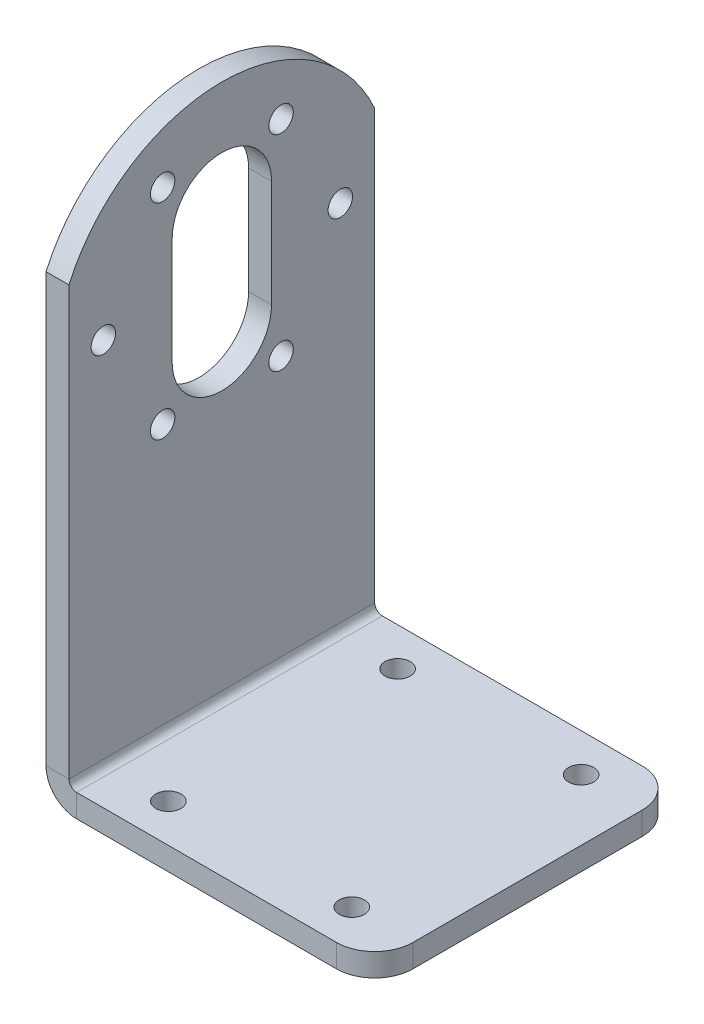
ISO-10303-21;
HEADER;
FILE_DESCRIPTION(('STEP AP214'),'2;1');
FILE_NAME('part.step','',(''),(''),'','','');
FILE_SCHEMA(('AUTOMOTIVE_DESIGN { 1 0 10303 214 1 1 1 1 }'));
ENDSEC;
DATA;
#1=APPLICATION_CONTEXT('core data for automotive mechanical design processes');
#2=APPLICATION_PROTOCOL_DEFINITION('international standard','automotive_design',2000,#1);
#3=PRODUCT_CONTEXT('',#1,'mechanical');
#4=PRODUCT('Part','Part','',(#3));
#5=PRODUCT_RELATED_PRODUCT_CATEGORY('part','',(#4));
#6=PRODUCT_DEFINITION_FORMATION('','',#4);
#7=PRODUCT_DEFINITION_CONTEXT('part definition',#1,'design');
#8=PRODUCT_DEFINITION('design','',#6,#7);
#9=PRODUCT_DEFINITION_SHAPE('','',#8);
#10=(LENGTH_UNIT() NAMED_UNIT(*) SI_UNIT(.MILLI.,.METRE.));
#11=(NAMED_UNIT(*) PLANE_ANGLE_UNIT() SI_UNIT($,.RADIAN.));
#12=(NAMED_UNIT(*) SI_UNIT($,.STERADIAN.) SOLID_ANGLE_UNIT());
#13=UNCERTAINTY_MEASURE_WITH_UNIT(LENGTH_MEASURE(1.E-05),#10,'distance_accuracy_value','');
#14=(GEOMETRIC_REPRESENTATION_CONTEXT(3) GLOBAL_UNCERTAINTY_ASSIGNED_CONTEXT((#13)) GLOBAL_UNIT_ASSIGNED_CONTEXT((#10,
#11,#12)) REPRESENTATION_CONTEXT('',''));
#15=CARTESIAN_POINT('',(0.,0.,0.));
#16=DIRECTION('',(0.,0.,1.));
#17=DIRECTION('',(1.,0.,0.));
#18=AXIS2_PLACEMENT_3D('',#15,#16,#17);
#19=CARTESIAN_POINT('',(7.99999999999999,70.,5.));
#20=DIRECTION('',(0.,-1.,0.));
#21=DIRECTION('',(0.,0.,-1.));
#22=AXIS2_PLACEMENT_3D('',#19,#20,#21);
#23=CYLINDRICAL_SURFACE('',#22,1.65);
#24=CARTESIAN_POINT('',(7.99999999999999,0.,5.));
#25=DIRECTION('',(0.,1.,0.));
#26=DIRECTION('',(0.,0.,1.));
#27=AXIS2_PLACEMENT_3D('',#24,#25,#26);
#28=CIRCLE('',#27,1.65);
#29=CARTESIAN_POINT('',(7.99999999999999,0.,6.65));
#30=VERTEX_POINT('',#29);
#31=EDGE_CURVE('E260',#30,#30,#28,.T.);
#32=ORIENTED_EDGE('',*,*,#31,.T.);
#33=EDGE_LOOP('',(#32));
#34=FACE_BOUND('',#33,.T.);
#35=CARTESIAN_POINT('',(7.99999999999999,-3.,5.));
#36=DIRECTION('',(0.,-1.,0.));
#37=DIRECTION('',(0.,0.,-1.));
#38=AXIS2_PLACEMENT_3D('',#35,#36,#37);
#39=CIRCLE('',#38,1.65);
#40=CARTESIAN_POINT('',(7.99999999999999,-3.,3.35000000000001));
#41=VERTEX_POINT('',#40);
#42=EDGE_CURVE('E263',#41,#41,#39,.T.);
#43=ORIENTED_EDGE('',*,*,#42,.T.);
#44=EDGE_LOOP('',(#43));
#45=FACE_BOUND('',#44,.T.);
#46=ADVANCED_FACE('F39',(#34,#45),#23,.F.);
#47=CARTESIAN_POINT('',(7.99999999999999,70.,35.));
#48=DIRECTION('',(0.,-1.,0.));
#49=DIRECTION('',(0.,0.,-1.));
#50=AXIS2_PLACEMENT_3D('',#47,#48,#49);
#51=CYLINDRICAL_SURFACE('',#50,1.65);
#52=CARTESIAN_POINT('',(7.99999999999999,0.,35.));
#53=DIRECTION('',(0.,1.,0.));
#54=DIRECTION('',(0.,0.,1.));
#55=AXIS2_PLACEMENT_3D('',#52,#53,#54);
#56=CIRCLE('',#55,1.65);
#57=CARTESIAN_POINT('',(7.99999999999999,0.,36.65));
#58=VERTEX_POINT('',#57);
#59=EDGE_CURVE('E249',#58,#58,#56,.T.);
#60=ORIENTED_EDGE('',*,*,#59,.T.);
#61=EDGE_LOOP('',(#60));
#62=FACE_BOUND('',#61,.T.);
#63=CARTESIAN_POINT('',(7.99999999999999,-3.,35.));
#64=DIRECTION('',(0.,-1.,0.));
#65=DIRECTION('',(0.,0.,-1.));
#66=AXIS2_PLACEMENT_3D('',#63,#64,#65);
#67=CIRCLE('',#66,1.65);
#68=CARTESIAN_POINT('',(7.99999999999999,-3.,33.35));
#69=VERTEX_POINT('',#68);
#70=EDGE_CURVE('E257',#69,#69,#67,.T.);
#71=ORIENTED_EDGE('',*,*,#70,.T.);
#72=EDGE_LOOP('',(#71));
#73=FACE_BOUND('',#72,.T.);
#74=ADVANCED_FACE('F345',(#62,#73),#51,.F.);
#75=CARTESIAN_POINT('',(0.,0.,40.));
#76=DIRECTION('',(1.,0.,0.));
#77=DIRECTION('',(0.,0.,-1.));
#78=AXIS2_PLACEMENT_3D('',#75,#76,#77);
#79=PLANE('',#78);
#80=CARTESIAN_POINT('',(0.,48.5,4.5));
#81=DIRECTION('',(1.,0.,0.));
#82=DIRECTION('',(0.,0.,-1.));
#83=AXIS2_PLACEMENT_3D('',#80,#81,#82);
#84=CIRCLE('',#83,1.6);
#85=CARTESIAN_POINT('',(0.,48.5,2.90000000000001));
#86=VERTEX_POINT('',#85);
#87=EDGE_CURVE('E662',#86,#86,#84,.T.);
#88=ORIENTED_EDGE('',*,*,#87,.F.);
#89=EDGE_LOOP('',(#88));
#90=FACE_BOUND('',#89,.T.);
#91=CARTESIAN_POINT('',(0.,61.9233937586588,12.25));
#92=DIRECTION('',(1.,0.,0.));
#93=DIRECTION('',(0.,0.,-1.));
#94=AXIS2_PLACEMENT_3D('',#91,#92,#93);
#95=CIRCLE('',#94,1.59999999999995);
#96=CARTESIAN_POINT('',(0.,61.9233937586588,10.65));
#97=VERTEX_POINT('',#96);
#98=EDGE_CURVE('E666',#97,#97,#95,.T.);
#99=ORIENTED_EDGE('',*,*,#98,.F.);
#100=EDGE_LOOP('',(#99));
#101=FACE_BOUND('',#100,.T.);
#102=CARTESIAN_POINT('',(0.,61.9233937586588,27.75));
#103=DIRECTION('',(1.,0.,0.));
#104=DIRECTION('',(0.,0.,-1.));
#105=AXIS2_PLACEMENT_3D('',#102,#103,#104);
#106=CIRCLE('',#105,1.60000000000001);
#107=CARTESIAN_POINT('',(0.,61.9233937586588,26.15));
#108=VERTEX_POINT('',#107);
#109=EDGE_CURVE('E670',#108,#108,#106,.T.);
#110=ORIENTED_EDGE('',*,*,#109,.F.);
#111=EDGE_LOOP('',(#110));
#112=FACE_BOUND('',#111,.T.);
#113=CARTESIAN_POINT('',(0.,48.5,35.5));
#114=DIRECTION('',(1.,0.,0.));
#115=DIRECTION('',(0.,0.,-1.));
#116=AXIS2_PLACEMENT_3D('',#113,#114,#115);
#117=CIRCLE('',#116,1.60000000000001);
#118=CARTESIAN_POINT('',(0.,48.5,33.9));
#119=VERTEX_POINT('',#118);
#120=EDGE_CURVE('E674',#119,#119,#117,.T.);
#121=ORIENTED_EDGE('',*,*,#120,.F.);
#122=EDGE_LOOP('',(#121));
#123=FACE_BOUND('',#122,.T.);
#124=CARTESIAN_POINT('',(0.,35.0766062413412,27.75));
#125=DIRECTION('',(1.,0.,0.));
#126=DIRECTION('',(0.,0.,-1.));
#127=AXIS2_PLACEMENT_3D('',#124,#125,#126);
#128=CIRCLE('',#127,1.6);
#129=CARTESIAN_POINT('',(0.,35.0766062413412,26.15));
#130=VERTEX_POINT('',#129);
#131=EDGE_CURVE('E678',#130,#130,#128,.T.);
#132=ORIENTED_EDGE('',*,*,#131,.F.);
#133=EDGE_LOOP('',(#132));
#134=FACE_BOUND('',#133,.T.);
#135=CARTESIAN_POINT('',(0.,35.0766062413412,12.25));
#136=DIRECTION('',(1.,0.,0.));
#137=DIRECTION('',(0.,0.,-1.));
#138=AXIS2_PLACEMENT_3D('',#135,#136,#137);
#139=CIRCLE('',#138,1.6);
#140=CARTESIAN_POINT('',(0.,35.0766062413412,10.65));
#141=VERTEX_POINT('',#140);
#142=EDGE_CURVE('E682',#141,#141,#139,.T.);
#143=ORIENTED_EDGE('',*,*,#142,.F.);
#144=EDGE_LOOP('',(#143));
#145=FACE_BOUND('',#144,.T.);
#146=CARTESIAN_POINT('',(0.,55.5,20.));
#147=DIRECTION('',(1.,0.,0.));
#148=DIRECTION('',(0.,0.,-1.));
#149=AXIS2_PLACEMENT_3D('',#146,#147,#148);
#150=CIRCLE('',#149,6.5);
#151=CARTESIAN_POINT('',(0.,55.5,13.5));
#152=VERTEX_POINT('',#151);
#153=CARTESIAN_POINT('',(0.,55.5,26.5));
#154=VERTEX_POINT('',#153);
#155=EDGE_CURVE('E182',#152,#154,#150,.T.);
#156=ORIENTED_EDGE('',*,*,#155,.F.);
#157=DIRECTION('',(0.,1.,0.));
#158=VECTOR('',#157,1.);
#159=CARTESIAN_POINT('',(0.,0.,13.5));
#160=LINE('',#159,#158);
#161=CARTESIAN_POINT('',(0.,41.5,13.5));
#162=VERTEX_POINT('',#161);
#163=EDGE_CURVE('E175',#162,#152,#160,.T.);
#164=ORIENTED_EDGE('',*,*,#163,.F.);
#165=CARTESIAN_POINT('',(0.,41.5,20.));
#166=DIRECTION('',(1.,0.,0.));
#167=DIRECTION('',(0.,0.,-1.));
#168=AXIS2_PLACEMENT_3D('',#165,#166,#167);
#169=CIRCLE('',#168,6.49999999999999);
#170=CARTESIAN_POINT('',(0.,41.5,26.5));
#171=VERTEX_POINT('',#170);
#172=EDGE_CURVE('E150',#171,#162,#169,.T.);
#173=ORIENTED_EDGE('',*,*,#172,.F.);
#174=DIRECTION('',(0.,-1.,0.));
#175=VECTOR('',#174,1.);
#176=CARTESIAN_POINT('',(0.,0.,26.5));
#177=LINE('',#176,#175);
#178=EDGE_CURVE('E180',#154,#171,#177,.T.);
#179=ORIENTED_EDGE('',*,*,#178,.F.);
#180=EDGE_LOOP('',(#156,#164,#173,#179));
#181=FACE_BOUND('',#180,.T.);
#182=CARTESIAN_POINT('',(0.,48.1134778286727,20.));
#183=DIRECTION('',(1.,0.,0.));
#184=DIRECTION('',(0.,0.,-1.));
#185=AXIS2_PLACEMENT_3D('',#182,#183,#184);
#186=CIRCLE('',#185,21.8865221713273);
#187=CARTESIAN_POINT('',(0.,57.0027889806126,40.));
#188=VERTEX_POINT('',#187);
#189=CARTESIAN_POINT('',(0.,57.0027889806126,0.));
#190=VERTEX_POINT('',#189);
#191=EDGE_CURVE('E188',#188,#190,#186,.F.);
#192=ORIENTED_EDGE('',*,*,#191,.F.);
#193=DIRECTION('',(0.,-1.,0.));
#194=VECTOR('',#193,1.);
#195=CARTESIAN_POINT('',(0.,0.,40.));
#196=LINE('',#195,#194);
#197=CARTESIAN_POINT('',(0.,1.,40.));
#198=VERTEX_POINT('',#197);
#199=EDGE_CURVE('E199',#188,#198,#196,.T.);
#200=ORIENTED_EDGE('',*,*,#199,.T.);
#201=DIRECTION('',(0.,0.,-1.));
#202=VECTOR('',#201,1.);
#203=CARTESIAN_POINT('',(0.,1.,40.));
#204=LINE('',#203,#202);
#205=CARTESIAN_POINT('',(0.,1.,0.));
#206=VERTEX_POINT('',#205);
#207=EDGE_CURVE('E226',#198,#206,#204,.T.);
#208=ORIENTED_EDGE('',*,*,#207,.T.);
#209=DIRECTION('',(0.,-1.,0.));
#210=VECTOR('',#209,1.);
#211=CARTESIAN_POINT('',(0.,0.,0.));
#212=LINE('',#211,#210);
#213=EDGE_CURVE('E215',#190,#206,#212,.T.);
#214=ORIENTED_EDGE('',*,*,#213,.F.);
#215=EDGE_LOOP('',(#192,#200,#208,#214));
#216=FACE_BOUND('',#215,.T.);
#217=ADVANCED_FACE('F319',(#90,#101,#112,#123,#134,#145,#181,#216),#79,.T.);
#218=CARTESIAN_POINT('',(-3.,0.,40.));
#219=DIRECTION('',(1.,0.,0.));
#220=DIRECTION('',(0.,0.,-1.));
#221=AXIS2_PLACEMENT_3D('',#218,#219,#220);
#222=PLANE('',#221);
#223=CARTESIAN_POINT('',(-3.,48.5,4.5));
#224=DIRECTION('',(-1.,0.,0.));
#225=DIRECTION('',(0.,0.,1.));
#226=AXIS2_PLACEMENT_3D('',#223,#224,#225);
#227=CIRCLE('',#226,1.6);
#228=CARTESIAN_POINT('',(-3.,48.5,6.1));
#229=VERTEX_POINT('',#228);
#230=EDGE_CURVE('E693',#229,#229,#227,.T.);
#231=ORIENTED_EDGE('',*,*,#230,.F.);
#232=EDGE_LOOP('',(#231));
#233=FACE_BOUND('',#232,.T.);
#234=CARTESIAN_POINT('',(-3.,61.9233937586588,12.25));
#235=DIRECTION('',(-1.,0.,0.));
#236=DIRECTION('',(0.,0.,1.));
#237=AXIS2_PLACEMENT_3D('',#234,#235,#236);
#238=CIRCLE('',#237,1.59999999999995);
#239=CARTESIAN_POINT('',(-3.,61.9233937586588,13.8499999999999));
#240=VERTEX_POINT('',#239);
#241=EDGE_CURVE('E253',#240,#240,#238,.T.);
#242=ORIENTED_EDGE('',*,*,#241,.F.);
#243=EDGE_LOOP('',(#242));
#244=FACE_BOUND('',#243,.T.);
#245=CARTESIAN_POINT('',(-3.,61.9233937586588,27.75));
#246=DIRECTION('',(-1.,0.,0.));
#247=DIRECTION('',(0.,0.,1.));
#248=AXIS2_PLACEMENT_3D('',#245,#246,#247);
#249=CIRCLE('',#248,1.60000000000001);
#250=CARTESIAN_POINT('',(-3.,61.9233937586588,29.35));
#251=VERTEX_POINT('',#250);
#252=EDGE_CURVE('E694',#251,#251,#249,.T.);
#253=ORIENTED_EDGE('',*,*,#252,.F.);
#254=EDGE_LOOP('',(#253));
#255=FACE_BOUND('',#254,.T.);
#256=CARTESIAN_POINT('',(-3.,48.5,35.5));
#257=DIRECTION('',(-1.,0.,0.));
#258=DIRECTION('',(0.,0.,1.));
#259=AXIS2_PLACEMENT_3D('',#256,#257,#258);
#260=CIRCLE('',#259,1.60000000000001);
#261=CARTESIAN_POINT('',(-3.,48.5,37.1));
#262=VERTEX_POINT('',#261);
#263=EDGE_CURVE('E697',#262,#262,#260,.T.);
#264=ORIENTED_EDGE('',*,*,#263,.F.);
#265=EDGE_LOOP('',(#264));
#266=FACE_BOUND('',#265,.T.);
#267=CARTESIAN_POINT('',(-3.,35.0766062413412,27.75));
#268=DIRECTION('',(-1.,0.,0.));
#269=DIRECTION('',(0.,0.,1.));
#270=AXIS2_PLACEMENT_3D('',#267,#268,#269);
#271=CIRCLE('',#270,1.6);
#272=CARTESIAN_POINT('',(-3.,35.0766062413412,29.35));
#273=VERTEX_POINT('',#272);
#274=EDGE_CURVE('E700',#273,#273,#271,.T.);
#275=ORIENTED_EDGE('',*,*,#274,.F.);
#276=EDGE_LOOP('',(#275));
#277=FACE_BOUND('',#276,.T.);
#278=CARTESIAN_POINT('',(-3.,35.0766062413412,12.25));
#279=DIRECTION('',(-1.,0.,0.));
#280=DIRECTION('',(0.,0.,1.));
#281=AXIS2_PLACEMENT_3D('',#278,#279,#280);
#282=CIRCLE('',#281,1.6);
#283=CARTESIAN_POINT('',(-3.,35.0766062413412,13.85));
#284=VERTEX_POINT('',#283);
#285=EDGE_CURVE('E703',#284,#284,#282,.T.);
#286=ORIENTED_EDGE('',*,*,#285,.F.);
#287=EDGE_LOOP('',(#286));
#288=FACE_BOUND('',#287,.T.);
#289=DIRECTION('',(0.,-1.,0.));
#290=VECTOR('',#289,1.);
#291=CARTESIAN_POINT('',(-3.,55.5,13.5));
#292=LINE('',#291,#290);
#293=CARTESIAN_POINT('',(-3.,55.5,13.5));
#294=VERTEX_POINT('',#293);
#295=CARTESIAN_POINT('',(-3.,41.5,13.5));
#296=VERTEX_POINT('',#295);
#297=EDGE_CURVE('E158',#294,#296,#292,.T.);
#298=ORIENTED_EDGE('',*,*,#297,.F.);
#299=CARTESIAN_POINT('',(-3.,55.5,20.));
#300=DIRECTION('',(-1.,0.,0.));
#301=DIRECTION('',(0.,0.,1.));
#302=AXIS2_PLACEMENT_3D('',#299,#300,#301);
#303=CIRCLE('',#302,6.5);
#304=CARTESIAN_POINT('',(-3.,55.5,26.5));
#305=VERTEX_POINT('',#304);
#306=EDGE_CURVE('E163',#305,#294,#303,.T.);
#307=ORIENTED_EDGE('',*,*,#306,.F.);
#308=DIRECTION('',(0.,1.,0.));
#309=VECTOR('',#308,1.);
#310=CARTESIAN_POINT('',(-3.,55.5,26.5));
#311=LINE('',#310,#309);
#312=CARTESIAN_POINT('',(-3.,41.5,26.5));
#313=VERTEX_POINT('',#312);
#314=EDGE_CURVE('E168',#313,#305,#311,.T.);
#315=ORIENTED_EDGE('',*,*,#314,.F.);
#316=CARTESIAN_POINT('',(-3.,41.5,20.));
#317=DIRECTION('',(-1.,0.,0.));
#318=DIRECTION('',(0.,0.,1.));
#319=AXIS2_PLACEMENT_3D('',#316,#317,#318);
#320=CIRCLE('',#319,6.49999999999999);
#321=EDGE_CURVE('E147',#296,#313,#320,.T.);
#322=ORIENTED_EDGE('',*,*,#321,.F.);
#323=EDGE_LOOP('',(#298,#307,#315,#322));
#324=FACE_BOUND('',#323,.T.);
#325=DIRECTION('',(0.,1.,0.));
#326=VECTOR('',#325,1.);
#327=CARTESIAN_POINT('',(-3.,0.,40.));
#328=LINE('',#327,#326);
#329=CARTESIAN_POINT('',(-3.,57.0027889806126,40.));
#330=VERTEX_POINT('',#329);
#331=CARTESIAN_POINT('',(-3.,1.,40.));
#332=VERTEX_POINT('',#331);
#333=EDGE_CURVE('E201',#330,#332,#328,.F.);
#334=ORIENTED_EDGE('',*,*,#333,.F.);
#335=CARTESIAN_POINT('',(-3.,48.1134778286727,20.));
#336=DIRECTION('',(-1.,0.,0.));
#337=DIRECTION('',(0.,0.,1.));
#338=AXIS2_PLACEMENT_3D('',#335,#336,#337);
#339=CIRCLE('',#338,21.8865221713273);
#340=CARTESIAN_POINT('',(-3.,57.0027889806126,0.));
#341=VERTEX_POINT('',#340);
#342=EDGE_CURVE('E184',#341,#330,#339,.F.);
#343=ORIENTED_EDGE('',*,*,#342,.F.);
#344=DIRECTION('',(0.,1.,0.));
#345=VECTOR('',#344,1.);
#346=CARTESIAN_POINT('',(-3.,0.,0.));
#347=LINE('',#346,#345);
#348=CARTESIAN_POINT('',(-3.,1.,0.));
#349=VERTEX_POINT('',#348);
#350=EDGE_CURVE('E217',#341,#349,#347,.F.);
#351=ORIENTED_EDGE('',*,*,#350,.T.);
#352=DIRECTION('',(0.,0.,-1.));
#353=VECTOR('',#352,1.);
#354=CARTESIAN_POINT('',(-3.,1.,40.));
#355=LINE('',#354,#353);
#356=EDGE_CURVE('E223',#332,#349,#355,.T.);
#357=ORIENTED_EDGE('',*,*,#356,.F.);
#358=EDGE_LOOP('',(#334,#343,#351,#357));
#359=FACE_BOUND('',#358,.T.);
#360=ADVANCED_FACE('F165',(#233,#244,#255,#266,#277,#288,#324,#359),#222,.F.);
#361=CARTESIAN_POINT('',(1.,0.,40.));
#362=DIRECTION('',(0.,0.,1.));
#363=DIRECTION('',(1.,0.,0.));
#364=AXIS2_PLACEMENT_3D('',#361,#362,#363);
#365=PLANE('',#364);
#366=DIRECTION('',(0.,-1.,0.));
#367=VECTOR('',#366,1.);
#368=CARTESIAN_POINT('',(1.,0.,40.));
#369=LINE('',#368,#367);
#370=CARTESIAN_POINT('',(1.,0.,40.));
#371=VERTEX_POINT('',#370);
#372=CARTESIAN_POINT('',(1.,-3.,40.));
#373=VERTEX_POINT('',#372);
#374=EDGE_CURVE('E244',#371,#373,#369,.T.);
#375=ORIENTED_EDGE('',*,*,#374,.F.);
#376=CARTESIAN_POINT('',(1.,1.,40.));
#377=DIRECTION('',(0.,0.,-1.));
#378=DIRECTION('',(-1.,0.,0.));
#379=AXIS2_PLACEMENT_3D('',#376,#377,#378);
#380=CIRCLE('',#379,1.);
#381=EDGE_CURVE('E196',#198,#371,#380,.F.);
#382=ORIENTED_EDGE('',*,*,#381,.F.);
#383=DIRECTION('',(1.,0.,0.));
#384=VECTOR('',#383,1.);
#385=CARTESIAN_POINT('',(-3.,1.,40.));
#386=LINE('',#385,#384);
#387=EDGE_CURVE('E241',#332,#198,#386,.T.);
#388=ORIENTED_EDGE('',*,*,#387,.F.);
#389=CARTESIAN_POINT('',(1.,1.,40.));
#390=DIRECTION('',(0.,0.,1.));
#391=DIRECTION('',(1.,0.,0.));
#392=AXIS2_PLACEMENT_3D('',#389,#390,#391);
#393=CIRCLE('',#392,4.);
#394=EDGE_CURVE('E203',#332,#373,#393,.T.);
#395=ORIENTED_EDGE('',*,*,#394,.T.);
#396=EDGE_LOOP('',(#375,#382,#388,#395));
#397=FACE_BOUND('',#396,.T.);
#398=ADVANCED_FACE('F305',(#397),#365,.T.);
#399=CARTESIAN_POINT('',(-3.,1.,40.));
#400=DIRECTION('',(0.,0.,1.));
#401=DIRECTION('',(1.,0.,0.));
#402=AXIS2_PLACEMENT_3D('',#399,#400,#401);
#403=PLANE('',#402);
#404=DIRECTION('',(1.,0.,0.));
#405=VECTOR('',#404,1.);
#406=CARTESIAN_POINT('',(0.,-3.,40.));
#407=LINE('',#406,#405);
#408=CARTESIAN_POINT('',(35.,-3.,40.));
#409=VERTEX_POINT('',#408);
#410=EDGE_CURVE('E191',#373,#409,#407,.T.);
#411=ORIENTED_EDGE('',*,*,#410,.T.);
#412=DIRECTION('',(0.,-1.,0.));
#413=VECTOR('',#412,1.);
#414=CARTESIAN_POINT('',(35.,1.,40.));
#415=LINE('',#414,#413);
#416=CARTESIAN_POINT('',(35.,0.,40.));
#417=VERTEX_POINT('',#416);
#418=EDGE_CURVE('E11',#409,#417,#415,.F.);
#419=ORIENTED_EDGE('',*,*,#418,.T.);
#420=DIRECTION('',(1.,0.,0.));
#421=VECTOR('',#420,1.);
#422=CARTESIAN_POINT('',(0.,0.,40.));
#423=LINE('',#422,#421);
#424=EDGE_CURVE('E193',#371,#417,#423,.T.);
#425=ORIENTED_EDGE('',*,*,#424,.F.);
#426=ORIENTED_EDGE('',*,*,#374,.T.);
#427=EDGE_LOOP('',(#411,#419,#425,#426));
#428=FACE_BOUND('',#427,.T.);
#429=ADVANCED_FACE('F299',(#428),#403,.T.);
#430=CARTESIAN_POINT('',(0.,1.,0.));
#431=DIRECTION('',(0.,0.,-1.));
#432=DIRECTION('',(-1.,0.,0.));
#433=AXIS2_PLACEMENT_3D('',#430,#431,#432);
#434=PLANE('',#433);
#435=DIRECTION('',(-1.,0.,0.));
#436=VECTOR('',#435,1.);
#437=CARTESIAN_POINT('',(0.,1.,0.));
#438=LINE('',#437,#436);
#439=EDGE_CURVE('E238',#206,#349,#438,.T.);
#440=ORIENTED_EDGE('',*,*,#439,.F.);
#441=CARTESIAN_POINT('',(1.,1.,0.));
#442=DIRECTION('',(0.,0.,-1.));
#443=DIRECTION('',(-1.,0.,0.));
#444=AXIS2_PLACEMENT_3D('',#441,#442,#443);
#445=CIRCLE('',#444,1.);
#446=CARTESIAN_POINT('',(1.,0.,0.));
#447=VERTEX_POINT('',#446);
#448=EDGE_CURVE('E212',#206,#447,#445,.F.);
#449=ORIENTED_EDGE('',*,*,#448,.T.);
#450=DIRECTION('',(0.,1.,0.));
#451=VECTOR('',#450,1.);
#452=CARTESIAN_POINT('',(1.,-3.,0.));
#453=LINE('',#452,#451);
#454=CARTESIAN_POINT('',(1.,-3.,0.));
#455=VERTEX_POINT('',#454);
#456=EDGE_CURVE('E236',#455,#447,#453,.T.);
#457=ORIENTED_EDGE('',*,*,#456,.F.);
#458=CARTESIAN_POINT('',(1.,1.,0.));
#459=DIRECTION('',(0.,0.,1.));
#460=DIRECTION('',(1.,0.,0.));
#461=AXIS2_PLACEMENT_3D('',#458,#459,#460);
#462=CIRCLE('',#461,4.);
#463=EDGE_CURVE('E194',#349,#455,#462,.T.);
#464=ORIENTED_EDGE('',*,*,#463,.F.);
#465=EDGE_LOOP('',(#440,#449,#457,#464));
#466=FACE_BOUND('',#465,.T.);
#467=ADVANCED_FACE('F312',(#466),#434,.T.);
#468=CARTESIAN_POINT('',(1.,-3.,0.));
#469=DIRECTION('',(0.,0.,-1.));
#470=DIRECTION('',(-1.,0.,0.));
#471=AXIS2_PLACEMENT_3D('',#468,#469,#470);
#472=PLANE('',#471);
#473=DIRECTION('',(-1.,0.,0.));
#474=VECTOR('',#473,1.);
#475=CARTESIAN_POINT('',(7.,57.0027889806126,0.));
#476=LINE('',#475,#474);
#477=EDGE_CURVE('E186',#190,#341,#476,.T.);
#478=ORIENTED_EDGE('',*,*,#477,.F.);
#479=ORIENTED_EDGE('',*,*,#213,.T.);
#480=ORIENTED_EDGE('',*,*,#439,.T.);
#481=ORIENTED_EDGE('',*,*,#350,.F.);
#482=EDGE_LOOP('',(#478,#479,#480,#481));
#483=FACE_BOUND('',#482,.T.);
#484=ADVANCED_FACE('F329',(#483),#472,.T.);
#485=CARTESIAN_POINT('',(0.,-3.,40.));
#486=DIRECTION('',(0.,1.,0.));
#487=DIRECTION('',(0.,0.,1.));
#488=AXIS2_PLACEMENT_3D('',#485,#486,#487);
#489=PLANE('',#488);
#490=CARTESIAN_POINT('',(32.,-3.,5.));
#491=DIRECTION('',(0.,-1.,0.));
#492=DIRECTION('',(0.,0.,-1.));
#493=AXIS2_PLACEMENT_3D('',#490,#491,#492);
#494=CIRCLE('',#493,1.65);
#495=CARTESIAN_POINT('',(32.,-3.,3.35000000000001));
#496=VERTEX_POINT('',#495);
#497=EDGE_CURVE('E712',#496,#496,#494,.T.);
#498=ORIENTED_EDGE('',*,*,#497,.F.);
#499=EDGE_LOOP('',(#498));
#500=FACE_BOUND('',#499,.T.);
#501=CARTESIAN_POINT('',(32.,-3.,35.));
#502=DIRECTION('',(0.,-1.,0.));
#503=DIRECTION('',(0.,0.,-1.));
#504=AXIS2_PLACEMENT_3D('',#501,#502,#503);
#505=CIRCLE('',#504,1.65);
#506=CARTESIAN_POINT('',(32.,-3.,33.35));
#507=VERTEX_POINT('',#506);
#508=EDGE_CURVE('E254',#507,#507,#505,.T.);
#509=ORIENTED_EDGE('',*,*,#508,.F.);
#510=EDGE_LOOP('',(#509));
#511=FACE_BOUND('',#510,.T.);
#512=DIRECTION('',(1.,0.,0.));
#513=VECTOR('',#512,1.);
#514=CARTESIAN_POINT('',(0.,-3.,0.));
#515=LINE('',#514,#513);
#516=CARTESIAN_POINT('',(35.,-3.,0.));
#517=VERTEX_POINT('',#516);
#518=EDGE_CURVE('E190',#455,#517,#515,.T.);
#519=ORIENTED_EDGE('',*,*,#518,.T.);
#520=CARTESIAN_POINT('',(35.,-3.,5.));
#521=DIRECTION('',(0.,1.,0.));
#522=DIRECTION('',(0.,0.,1.));
#523=AXIS2_PLACEMENT_3D('',#520,#521,#522);
#524=CIRCLE('',#523,5.);
#525=CARTESIAN_POINT('',(40.,-3.,5.));
#526=VERTEX_POINT('',#525);
#527=EDGE_CURVE('E271',#517,#526,#524,.F.);
#528=ORIENTED_EDGE('',*,*,#527,.T.);
#529=DIRECTION('',(0.,0.,-1.));
#530=VECTOR('',#529,1.);
#531=CARTESIAN_POINT('',(40.,-3.,40.));
#532=LINE('',#531,#530);
#533=CARTESIAN_POINT('',(40.,-3.,35.));
#534=VERTEX_POINT('',#533);
#535=EDGE_CURVE('E234',#534,#526,#532,.T.);
#536=ORIENTED_EDGE('',*,*,#535,.F.);
#537=CARTESIAN_POINT('',(35.,-3.,35.));
#538=DIRECTION('',(0.,1.,0.));
#539=DIRECTION('',(0.,0.,1.));
#540=AXIS2_PLACEMENT_3D('',#537,#538,#539);
#541=CIRCLE('',#540,5.);
#542=EDGE_CURVE('E269',#534,#409,#541,.F.);
#543=ORIENTED_EDGE('',*,*,#542,.T.);
#544=ORIENTED_EDGE('',*,*,#410,.F.);
#545=DIRECTION('',(0.,0.,-1.));
#546=VECTOR('',#545,1.);
#547=CARTESIAN_POINT('',(1.,-3.,40.));
#548=LINE('',#547,#546);
#549=EDGE_CURVE('E206',#373,#455,#548,.T.);
#550=ORIENTED_EDGE('',*,*,#549,.T.);
#551=EDGE_LOOP('',(#519,#528,#536,#543,#544,#550));
#552=FACE_BOUND('',#551,.T.);
#553=ORIENTED_EDGE('',*,*,#70,.F.);
#554=EDGE_LOOP('',(#553));
#555=FACE_BOUND('',#554,.T.);
#556=ORIENTED_EDGE('',*,*,#42,.F.);
#557=EDGE_LOOP('',(#556));
#558=FACE_BOUND('',#557,.T.);
#559=ADVANCED_FACE('F292',(#500,#511,#552,#555,#558),#489,.F.);
#560=CARTESIAN_POINT('',(40.,0.,40.));
#561=DIRECTION('',(1.,0.,0.));
#562=DIRECTION('',(0.,0.,-1.));
#563=AXIS2_PLACEMENT_3D('',#560,#561,#562);
#564=PLANE('',#563);
#565=ORIENTED_EDGE('',*,*,#535,.T.);
#566=DIRECTION('',(0.,-1.,0.));
#567=VECTOR('',#566,1.);
#568=CARTESIAN_POINT('',(40.,0.,5.));
#569=LINE('',#568,#567);
#570=CARTESIAN_POINT('',(40.,0.,5.));
#571=VERTEX_POINT('',#570);
#572=EDGE_CURVE('E60',#526,#571,#569,.F.);
#573=ORIENTED_EDGE('',*,*,#572,.T.);
#574=DIRECTION('',(0.,0.,-1.));
#575=VECTOR('',#574,1.);
#576=CARTESIAN_POINT('',(40.,0.,40.));
#577=LINE('',#576,#575);
#578=CARTESIAN_POINT('',(40.,0.,35.));
#579=VERTEX_POINT('',#578);
#580=EDGE_CURVE('E232',#579,#571,#577,.T.);
#581=ORIENTED_EDGE('',*,*,#580,.F.);
#582=DIRECTION('',(0.,-1.,0.));
#583=VECTOR('',#582,1.);
#584=CARTESIAN_POINT('',(40.,0.,35.));
#585=LINE('',#584,#583);
#586=EDGE_CURVE('E273',#579,#534,#585,.T.);
#587=ORIENTED_EDGE('',*,*,#586,.T.);
#588=EDGE_LOOP('',(#565,#573,#581,#587));
#589=FACE_BOUND('',#588,.T.);
#590=ADVANCED_FACE('F294',(#589),#564,.T.);
#591=CARTESIAN_POINT('',(0.,0.,40.));
#592=DIRECTION('',(0.,1.,0.));
#593=DIRECTION('',(0.,0.,1.));
#594=AXIS2_PLACEMENT_3D('',#591,#592,#593);
#595=PLANE('',#594);
#596=CARTESIAN_POINT('',(32.,0.,5.));
#597=DIRECTION('',(0.,1.,0.));
#598=DIRECTION('',(0.,0.,1.));
#599=AXIS2_PLACEMENT_3D('',#596,#597,#598);
#600=CIRCLE('',#599,1.65);
#601=CARTESIAN_POINT('',(32.,0.,6.65));
#602=VERTEX_POINT('',#601);
#603=EDGE_CURVE('E715',#602,#602,#600,.T.);
#604=ORIENTED_EDGE('',*,*,#603,.F.);
#605=EDGE_LOOP('',(#604));
#606=FACE_BOUND('',#605,.T.);
#607=CARTESIAN_POINT('',(32.,0.,35.));
#608=DIRECTION('',(0.,1.,0.));
#609=DIRECTION('',(0.,0.,1.));
#610=AXIS2_PLACEMENT_3D('',#607,#608,#609);
#611=CIRCLE('',#610,1.65);
#612=CARTESIAN_POINT('',(32.,0.,36.65));
#613=VERTEX_POINT('',#612);
#614=EDGE_CURVE('E250',#613,#613,#611,.T.);
#615=ORIENTED_EDGE('',*,*,#614,.F.);
#616=EDGE_LOOP('',(#615));
#617=FACE_BOUND('',#616,.T.);
#618=ORIENTED_EDGE('',*,*,#580,.T.);
#619=CARTESIAN_POINT('',(35.,0.,5.));
#620=DIRECTION('',(0.,1.,0.));
#621=DIRECTION('',(0.,0.,1.));
#622=AXIS2_PLACEMENT_3D('',#619,#620,#621);
#623=CIRCLE('',#622,5.);
#624=CARTESIAN_POINT('',(35.,0.,0.));
#625=VERTEX_POINT('',#624);
#626=EDGE_CURVE('E47',#571,#625,#623,.T.);
#627=ORIENTED_EDGE('',*,*,#626,.T.);
#628=DIRECTION('',(1.,0.,0.));
#629=VECTOR('',#628,1.);
#630=CARTESIAN_POINT('',(0.,0.,0.));
#631=LINE('',#630,#629);
#632=EDGE_CURVE('E209',#447,#625,#631,.T.);
#633=ORIENTED_EDGE('',*,*,#632,.F.);
#634=DIRECTION('',(0.,0.,-1.));
#635=VECTOR('',#634,1.);
#636=CARTESIAN_POINT('',(1.,0.,40.));
#637=LINE('',#636,#635);
#638=EDGE_CURVE('E229',#371,#447,#637,.T.);
#639=ORIENTED_EDGE('',*,*,#638,.F.);
#640=ORIENTED_EDGE('',*,*,#424,.T.);
#641=CARTESIAN_POINT('',(35.,0.,35.));
#642=DIRECTION('',(0.,1.,0.));
#643=DIRECTION('',(0.,0.,1.));
#644=AXIS2_PLACEMENT_3D('',#641,#642,#643);
#645=CIRCLE('',#644,5.);
#646=EDGE_CURVE('E277',#417,#579,#645,.T.);
#647=ORIENTED_EDGE('',*,*,#646,.T.);
#648=EDGE_LOOP('',(#618,#627,#633,#639,#640,#647));
#649=FACE_BOUND('',#648,.T.);
#650=ORIENTED_EDGE('',*,*,#59,.F.);
#651=EDGE_LOOP('',(#650));
#652=FACE_BOUND('',#651,.T.);
#653=ORIENTED_EDGE('',*,*,#31,.F.);
#654=EDGE_LOOP('',(#653));
#655=FACE_BOUND('',#654,.T.);
#656=ADVANCED_FACE('F281',(#606,#617,#649,#652,#655),#595,.T.);
#657=CARTESIAN_POINT('',(1.,1.,40.));
#658=DIRECTION('',(0.,0.,-1.));
#659=DIRECTION('',(-1.,0.,0.));
#660=AXIS2_PLACEMENT_3D('',#657,#658,#659);
#661=CYLINDRICAL_SURFACE('',#660,1.);
#662=ORIENTED_EDGE('',*,*,#448,.F.);
#663=ORIENTED_EDGE('',*,*,#207,.F.);
#664=ORIENTED_EDGE('',*,*,#381,.T.);
#665=ORIENTED_EDGE('',*,*,#638,.T.);
#666=EDGE_LOOP('',(#662,#663,#664,#665));
#667=FACE_BOUND('',#666,.T.);
#668=ADVANCED_FACE('F316',(#667),#661,.F.);
#669=CARTESIAN_POINT('',(1.,1.,40.));
#670=DIRECTION('',(0.,0.,-1.));
#671=DIRECTION('',(-1.,0.,0.));
#672=AXIS2_PLACEMENT_3D('',#669,#670,#671);
#673=CYLINDRICAL_SURFACE('',#672,4.);
#674=ORIENTED_EDGE('',*,*,#463,.T.);
#675=ORIENTED_EDGE('',*,*,#549,.F.);
#676=ORIENTED_EDGE('',*,*,#394,.F.);
#677=ORIENTED_EDGE('',*,*,#356,.T.);
#678=EDGE_LOOP('',(#674,#675,#676,#677));
#679=FACE_BOUND('',#678,.T.);
#680=ADVANCED_FACE('F308',(#679),#673,.T.);
#681=CARTESIAN_POINT('',(1.,1.,40.));
#682=DIRECTION('',(0.,0.,-1.));
#683=DIRECTION('',(-1.,0.,0.));
#684=AXIS2_PLACEMENT_3D('',#681,#682,#683);
#685=PLANE('',#684);
#686=ORIENTED_EDGE('',*,*,#199,.F.);
#687=DIRECTION('',(-1.,0.,0.));
#688=VECTOR('',#687,1.);
#689=CARTESIAN_POINT('',(7.,57.0027889806126,40.));
#690=LINE('',#689,#688);
#691=EDGE_CURVE('E246',#188,#330,#690,.T.);
#692=ORIENTED_EDGE('',*,*,#691,.T.);
#693=ORIENTED_EDGE('',*,*,#333,.T.);
#694=ORIENTED_EDGE('',*,*,#387,.T.);
#695=EDGE_LOOP('',(#686,#692,#693,#694));
#696=FACE_BOUND('',#695,.T.);
#697=ADVANCED_FACE('F323',(#696),#685,.F.);
#698=CARTESIAN_POINT('',(1.,1.,0.));
#699=DIRECTION('',(0.,0.,-1.));
#700=DIRECTION('',(-1.,0.,0.));
#701=AXIS2_PLACEMENT_3D('',#698,#699,#700);
#702=PLANE('',#701);
#703=ORIENTED_EDGE('',*,*,#632,.T.);
#704=DIRECTION('',(0.,-1.,0.));
#705=VECTOR('',#704,1.);
#706=CARTESIAN_POINT('',(35.,1.,0.));
#707=LINE('',#706,#705);
#708=EDGE_CURVE('E266',#625,#517,#707,.T.);
#709=ORIENTED_EDGE('',*,*,#708,.T.);
#710=ORIENTED_EDGE('',*,*,#518,.F.);
#711=ORIENTED_EDGE('',*,*,#456,.T.);
#712=EDGE_LOOP('',(#703,#709,#710,#711));
#713=FACE_BOUND('',#712,.T.);
#714=ADVANCED_FACE('F287',(#713),#702,.T.);
#715=CARTESIAN_POINT('',(7.,48.1134778286727,20.));
#716=DIRECTION('',(-1.,0.,0.));
#717=DIRECTION('',(0.,0.,1.));
#718=AXIS2_PLACEMENT_3D('',#715,#716,#717);
#719=CYLINDRICAL_SURFACE('',#718,21.8865221713273);
#720=ORIENTED_EDGE('',*,*,#191,.T.);
#721=ORIENTED_EDGE('',*,*,#477,.T.);
#722=ORIENTED_EDGE('',*,*,#342,.T.);
#723=ORIENTED_EDGE('',*,*,#691,.F.);
#724=EDGE_LOOP('',(#720,#721,#722,#723));
#725=FACE_BOUND('',#724,.T.);
#726=ADVANCED_FACE('F331',(#725),#719,.T.);
#727=CARTESIAN_POINT('',(40.,55.5,20.));
#728=DIRECTION('',(-1.,0.,0.));
#729=DIRECTION('',(0.,0.,1.));
#730=AXIS2_PLACEMENT_3D('',#727,#728,#729);
#731=CYLINDRICAL_SURFACE('',#730,6.5);
#732=ORIENTED_EDGE('',*,*,#155,.T.);
#733=DIRECTION('',(-1.,0.,0.));
#734=VECTOR('',#733,1.);
#735=CARTESIAN_POINT('',(40.,55.5,26.5));
#736=LINE('',#735,#734);
#737=EDGE_CURVE('E173',#154,#305,#736,.T.);
#738=ORIENTED_EDGE('',*,*,#737,.T.);
#739=ORIENTED_EDGE('',*,*,#306,.T.);
#740=DIRECTION('',(-1.,0.,0.));
#741=VECTOR('',#740,1.);
#742=CARTESIAN_POINT('',(40.,55.5,13.5));
#743=LINE('',#742,#741);
#744=EDGE_CURVE('E154',#152,#294,#743,.T.);
#745=ORIENTED_EDGE('',*,*,#744,.F.);
#746=EDGE_LOOP('',(#732,#738,#739,#745));
#747=FACE_BOUND('',#746,.T.);
#748=ADVANCED_FACE('F333',(#747),#731,.F.);
#749=CARTESIAN_POINT('',(40.,55.5,26.5));
#750=DIRECTION('',(0.,0.,1.));
#751=DIRECTION('',(0.,-1.,0.));
#752=AXIS2_PLACEMENT_3D('',#749,#750,#751);
#753=PLANE('',#752);
#754=ORIENTED_EDGE('',*,*,#178,.T.);
#755=DIRECTION('',(-1.,0.,0.));
#756=VECTOR('',#755,1.);
#757=CARTESIAN_POINT('',(40.,41.5,26.5));
#758=LINE('',#757,#756);
#759=EDGE_CURVE('E153',#171,#313,#758,.T.);
#760=ORIENTED_EDGE('',*,*,#759,.T.);
#761=ORIENTED_EDGE('',*,*,#314,.T.);
#762=ORIENTED_EDGE('',*,*,#737,.F.);
#763=EDGE_LOOP('',(#754,#760,#761,#762));
#764=FACE_BOUND('',#763,.T.);
#765=ADVANCED_FACE('F339',(#764),#753,.F.);
#766=CARTESIAN_POINT('',(40.,41.5,20.));
#767=DIRECTION('',(-1.,0.,0.));
#768=DIRECTION('',(0.,0.,1.));
#769=AXIS2_PLACEMENT_3D('',#766,#767,#768);
#770=CYLINDRICAL_SURFACE('',#769,6.49999999999999);
#771=ORIENTED_EDGE('',*,*,#172,.T.);
#772=DIRECTION('',(-1.,0.,0.));
#773=VECTOR('',#772,1.);
#774=CARTESIAN_POINT('',(40.,41.5,13.5));
#775=LINE('',#774,#773);
#776=EDGE_CURVE('E142',#162,#296,#775,.T.);
#777=ORIENTED_EDGE('',*,*,#776,.T.);
#778=ORIENTED_EDGE('',*,*,#321,.T.);
#779=ORIENTED_EDGE('',*,*,#759,.F.);
#780=EDGE_LOOP('',(#771,#777,#778,#779));
#781=FACE_BOUND('',#780,.T.);
#782=ADVANCED_FACE('F144',(#781),#770,.F.);
#783=CARTESIAN_POINT('',(40.,55.5,13.5));
#784=DIRECTION('',(0.,0.,-1.));
#785=DIRECTION('',(0.,1.,0.));
#786=AXIS2_PLACEMENT_3D('',#783,#784,#785);
#787=PLANE('',#786);
#788=ORIENTED_EDGE('',*,*,#163,.T.);
#789=ORIENTED_EDGE('',*,*,#744,.T.);
#790=ORIENTED_EDGE('',*,*,#297,.T.);
#791=ORIENTED_EDGE('',*,*,#776,.F.);
#792=EDGE_LOOP('',(#788,#789,#790,#791));
#793=FACE_BOUND('',#792,.T.);
#794=ADVANCED_FACE('F159',(#793),#787,.F.);
#795=CARTESIAN_POINT('',(40.,35.0766062413412,12.25));
#796=DIRECTION('',(-1.,0.,0.));
#797=DIRECTION('',(0.,0.,1.));
#798=AXIS2_PLACEMENT_3D('',#795,#796,#797);
#799=CYLINDRICAL_SURFACE('',#798,1.6);
#800=ORIENTED_EDGE('',*,*,#142,.T.);
#801=EDGE_LOOP('',(#800));
#802=FACE_BOUND('',#801,.T.);
#803=ORIENTED_EDGE('',*,*,#285,.T.);
#804=EDGE_LOOP('',(#803));
#805=FACE_BOUND('',#804,.T.);
#806=ADVANCED_FACE('F381',(#802,#805),#799,.F.);
#807=CARTESIAN_POINT('',(40.,35.0766062413412,27.75));
#808=DIRECTION('',(-1.,0.,0.));
#809=DIRECTION('',(0.,0.,1.));
#810=AXIS2_PLACEMENT_3D('',#807,#808,#809);
#811=CYLINDRICAL_SURFACE('',#810,1.6);
#812=ORIENTED_EDGE('',*,*,#131,.T.);
#813=EDGE_LOOP('',(#812));
#814=FACE_BOUND('',#813,.T.);
#815=ORIENTED_EDGE('',*,*,#274,.T.);
#816=EDGE_LOOP('',(#815));
#817=FACE_BOUND('',#816,.T.);
#818=ADVANCED_FACE('F384',(#814,#817),#811,.F.);
#819=CARTESIAN_POINT('',(40.,48.5,35.5));
#820=DIRECTION('',(-1.,0.,0.));
#821=DIRECTION('',(0.,0.,1.));
#822=AXIS2_PLACEMENT_3D('',#819,#820,#821);
#823=CYLINDRICAL_SURFACE('',#822,1.60000000000001);
#824=ORIENTED_EDGE('',*,*,#120,.T.);
#825=EDGE_LOOP('',(#824));
#826=FACE_BOUND('',#825,.T.);
#827=ORIENTED_EDGE('',*,*,#263,.T.);
#828=EDGE_LOOP('',(#827));
#829=FACE_BOUND('',#828,.T.);
#830=ADVANCED_FACE('F388',(#826,#829),#823,.F.);
#831=CARTESIAN_POINT('',(40.,61.9233937586588,27.75));
#832=DIRECTION('',(-1.,0.,0.));
#833=DIRECTION('',(0.,0.,1.));
#834=AXIS2_PLACEMENT_3D('',#831,#832,#833);
#835=CYLINDRICAL_SURFACE('',#834,1.60000000000001);
#836=ORIENTED_EDGE('',*,*,#109,.T.);
#837=EDGE_LOOP('',(#836));
#838=FACE_BOUND('',#837,.T.);
#839=ORIENTED_EDGE('',*,*,#252,.T.);
#840=EDGE_LOOP('',(#839));
#841=FACE_BOUND('',#840,.T.);
#842=ADVANCED_FACE('F379',(#838,#841),#835,.F.);
#843=CARTESIAN_POINT('',(40.,61.9233937586588,12.25));
#844=DIRECTION('',(-1.,0.,0.));
#845=DIRECTION('',(0.,0.,1.));
#846=AXIS2_PLACEMENT_3D('',#843,#844,#845);
#847=CYLINDRICAL_SURFACE('',#846,1.59999999999995);
#848=ORIENTED_EDGE('',*,*,#98,.T.);
#849=EDGE_LOOP('',(#848));
#850=FACE_BOUND('',#849,.T.);
#851=ORIENTED_EDGE('',*,*,#241,.T.);
#852=EDGE_LOOP('',(#851));
#853=FACE_BOUND('',#852,.T.);
#854=ADVANCED_FACE('F375',(#850,#853),#847,.F.);
#855=CARTESIAN_POINT('',(40.,48.5,4.5));
#856=DIRECTION('',(-1.,0.,0.));
#857=DIRECTION('',(0.,0.,1.));
#858=AXIS2_PLACEMENT_3D('',#855,#856,#857);
#859=CYLINDRICAL_SURFACE('',#858,1.6);
#860=ORIENTED_EDGE('',*,*,#87,.T.);
#861=EDGE_LOOP('',(#860));
#862=FACE_BOUND('',#861,.T.);
#863=ORIENTED_EDGE('',*,*,#230,.T.);
#864=EDGE_LOOP('',(#863));
#865=FACE_BOUND('',#864,.T.);
#866=ADVANCED_FACE('F367',(#862,#865),#859,.F.);
#867=CARTESIAN_POINT('',(32.,70.,35.));
#868=DIRECTION('',(0.,-1.,0.));
#869=DIRECTION('',(0.,0.,-1.));
#870=AXIS2_PLACEMENT_3D('',#867,#868,#869);
#871=CYLINDRICAL_SURFACE('',#870,1.65);
#872=ORIENTED_EDGE('',*,*,#614,.T.);
#873=EDGE_LOOP('',(#872));
#874=FACE_BOUND('',#873,.T.);
#875=ORIENTED_EDGE('',*,*,#508,.T.);
#876=EDGE_LOOP('',(#875));
#877=FACE_BOUND('',#876,.T.);
#878=ADVANCED_FACE('F361',(#874,#877),#871,.F.);
#879=CARTESIAN_POINT('',(32.,70.,5.));
#880=DIRECTION('',(0.,-1.,0.));
#881=DIRECTION('',(0.,0.,-1.));
#882=AXIS2_PLACEMENT_3D('',#879,#880,#881);
#883=CYLINDRICAL_SURFACE('',#882,1.65);
#884=ORIENTED_EDGE('',*,*,#603,.T.);
#885=EDGE_LOOP('',(#884));
#886=FACE_BOUND('',#885,.T.);
#887=ORIENTED_EDGE('',*,*,#497,.T.);
#888=EDGE_LOOP('',(#887));
#889=FACE_BOUND('',#888,.T.);
#890=ADVANCED_FACE('F356',(#886,#889),#883,.F.);
#891=CARTESIAN_POINT('',(35.,1.,5.));
#892=DIRECTION('',(0.,-1.,0.));
#893=DIRECTION('',(0.,0.,-1.));
#894=AXIS2_PLACEMENT_3D('',#891,#892,#893);
#895=CYLINDRICAL_SURFACE('',#894,5.);
#896=ORIENTED_EDGE('',*,*,#626,.F.);
#897=ORIENTED_EDGE('',*,*,#572,.F.);
#898=ORIENTED_EDGE('',*,*,#527,.F.);
#899=ORIENTED_EDGE('',*,*,#708,.F.);
#900=EDGE_LOOP('',(#896,#897,#898,#899));
#901=FACE_BOUND('',#900,.T.);
#902=ADVANCED_FACE('F289',(#901),#895,.T.);
#903=CARTESIAN_POINT('',(35.,0.,35.));
#904=DIRECTION('',(0.,-1.,0.));
#905=DIRECTION('',(0.,0.,-1.));
#906=AXIS2_PLACEMENT_3D('',#903,#904,#905);
#907=CYLINDRICAL_SURFACE('',#906,5.);
#908=ORIENTED_EDGE('',*,*,#646,.F.);
#909=ORIENTED_EDGE('',*,*,#418,.F.);
#910=ORIENTED_EDGE('',*,*,#542,.F.);
#911=ORIENTED_EDGE('',*,*,#586,.F.);
#912=EDGE_LOOP('',(#908,#909,#910,#911));
#913=FACE_BOUND('',#912,.T.);
#914=ADVANCED_FACE('F41',(#913),#907,.T.);
#915=CLOSED_SHELL('',(#46,#74,#217,#360,#398,#429,#467,#484,#559,#590,#656,#668,#680,#697,#714,
#726,#748,#765,#782,#794,#806,#818,#830,#842,#854,#866,#878,#890,#902,#914));
#916=MANIFOLD_SOLID_BREP('B2',#915);
#917=ADVANCED_BREP_SHAPE_REPRESENTATION('',(#18,#916),#14);
#918=SHAPE_DEFINITION_REPRESENTATION(#9,#917);
ENDSEC;
END-ISO-10303-21;
